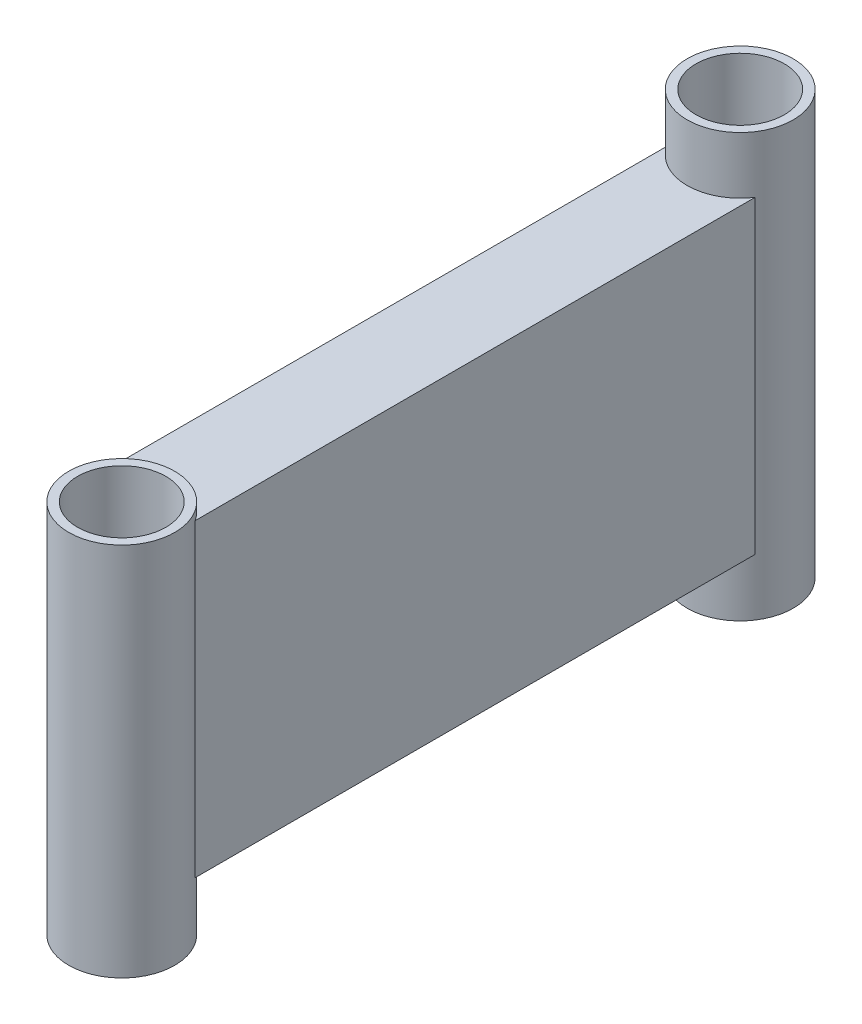
ISO-10303-21;
HEADER;
FILE_DESCRIPTION(('STEP AP214'),'2;1');
FILE_NAME('part.step','',(''),(''),'','','');
FILE_SCHEMA(('AUTOMOTIVE_DESIGN { 1 0 10303 214 1 1 1 1 }'));
ENDSEC;
DATA;
#1=APPLICATION_CONTEXT('core data for automotive mechanical design processes');
#2=APPLICATION_PROTOCOL_DEFINITION('international standard','automotive_design',2000,#1);
#3=PRODUCT_CONTEXT('',#1,'mechanical');
#4=PRODUCT('Part','Part','',(#3));
#5=PRODUCT_RELATED_PRODUCT_CATEGORY('part','',(#4));
#6=PRODUCT_DEFINITION_FORMATION('','',#4);
#7=PRODUCT_DEFINITION_CONTEXT('part definition',#1,'design');
#8=PRODUCT_DEFINITION('design','',#6,#7);
#9=PRODUCT_DEFINITION_SHAPE('','',#8);
#10=(LENGTH_UNIT() NAMED_UNIT(*) SI_UNIT(.MILLI.,.METRE.));
#11=(NAMED_UNIT(*) PLANE_ANGLE_UNIT() SI_UNIT($,.RADIAN.));
#12=(NAMED_UNIT(*) SI_UNIT($,.STERADIAN.) SOLID_ANGLE_UNIT());
#13=UNCERTAINTY_MEASURE_WITH_UNIT(LENGTH_MEASURE(1.E-05),#10,'distance_accuracy_value','');
#14=(GEOMETRIC_REPRESENTATION_CONTEXT(3) GLOBAL_UNCERTAINTY_ASSIGNED_CONTEXT((#13)) GLOBAL_UNIT_ASSIGNED_CONTEXT((#10,
#11,#12)) REPRESENTATION_CONTEXT('',''));
#15=CARTESIAN_POINT('',(0.,0.,0.));
#16=DIRECTION('',(0.,0.,1.));
#17=DIRECTION('',(1.,0.,0.));
#18=AXIS2_PLACEMENT_3D('',#15,#16,#17);
#19=CARTESIAN_POINT('',(0.,-23.9382502,65.));
#20=DIRECTION('',(0.,1.,0.));
#21=DIRECTION('',(0.,0.,1.));
#22=AXIS2_PLACEMENT_3D('',#19,#20,#21);
#23=CYLINDRICAL_SURFACE('',#22,6.00000000000001);
#24=CARTESIAN_POINT('',(0.,-23.9382502,65.));
#25=DIRECTION('',(0.,1.,0.));
#26=DIRECTION('',(0.,0.,1.));
#27=AXIS2_PLACEMENT_3D('',#24,#25,#26);
#28=CIRCLE('',#27,6.00000000000001);
#29=CARTESIAN_POINT('',(0.,-23.9382502,71.));
#30=VERTEX_POINT('',#29);
#31=EDGE_CURVE('E209',#30,#30,#28,.T.);
#32=ORIENTED_EDGE('',*,*,#31,.T.);
#33=EDGE_LOOP('',(#32));
#34=FACE_BOUND('',#33,.T.);
#35=CARTESIAN_POINT('',(0.,18.5,65.));
#36=DIRECTION('',(0.,1.,0.));
#37=DIRECTION('',(0.,0.,1.));
#38=AXIS2_PLACEMENT_3D('',#35,#36,#37);
#39=CIRCLE('',#38,6.00000000000001);
#40=CARTESIAN_POINT('',(0.,18.5,71.));
#41=VERTEX_POINT('',#40);
#42=EDGE_CURVE('E201',#41,#41,#39,.T.);
#43=ORIENTED_EDGE('',*,*,#42,.F.);
#44=EDGE_LOOP('',(#43));
#45=FACE_BOUND('',#44,.T.);
#46=CARTESIAN_POINT('',(0.,17.5,65.));
#47=DIRECTION('',(0.,-1.,0.));
#48=DIRECTION('',(0.,0.,-1.));
#49=AXIS2_PLACEMENT_3D('',#46,#47,#48);
#50=CIRCLE('',#49,6.00000000000001);
#51=CARTESIAN_POINT('',(-5.,17.5,61.6833752096446));
#52=VERTEX_POINT('',#51);
#53=CARTESIAN_POINT('',(5.,17.5,61.6833752096446));
#54=VERTEX_POINT('',#53);
#55=EDGE_CURVE('E105',#52,#54,#50,.T.);
#56=ORIENTED_EDGE('',*,*,#55,.F.);
#57=DIRECTION('',(0.,1.,0.));
#58=VECTOR('',#57,1.);
#59=CARTESIAN_POINT('',(-5.,-23.9382502,61.6833752096446));
#60=LINE('',#59,#58);
#61=CARTESIAN_POINT('',(-5.,-17.5,61.6833752096446));
#62=VERTEX_POINT('',#61);
#63=EDGE_CURVE('E186',#62,#52,#60,.T.);
#64=ORIENTED_EDGE('',*,*,#63,.F.);
#65=CARTESIAN_POINT('',(0.,-17.5,65.));
#66=DIRECTION('',(0.,1.,0.));
#67=DIRECTION('',(0.,0.,1.));
#68=AXIS2_PLACEMENT_3D('',#65,#66,#67);
#69=CIRCLE('',#68,6.00000000000001);
#70=CARTESIAN_POINT('',(5.,-17.5,61.6833752096446));
#71=VERTEX_POINT('',#70);
#72=EDGE_CURVE('E180',#71,#62,#69,.T.);
#73=ORIENTED_EDGE('',*,*,#72,.F.);
#74=DIRECTION('',(0.,1.,0.));
#75=VECTOR('',#74,1.);
#76=CARTESIAN_POINT('',(5.,-23.9382502,61.6833752096446));
#77=LINE('',#76,#75);
#78=EDGE_CURVE('E190',#54,#71,#77,.F.);
#79=ORIENTED_EDGE('',*,*,#78,.F.);
#80=EDGE_LOOP('',(#56,#64,#73,#79));
#81=FACE_BOUND('',#80,.T.);
#82=ADVANCED_FACE('F88',(#34,#45,#81),#23,.T.);
#83=CARTESIAN_POINT('',(0.,-23.9382502,-5.));
#84=DIRECTION('',(0.,1.,0.));
#85=DIRECTION('',(0.,0.,1.));
#86=AXIS2_PLACEMENT_3D('',#83,#84,#85);
#87=CYLINDRICAL_SURFACE('',#86,6.);
#88=CARTESIAN_POINT('',(0.,-23.9382502,-5.));
#89=DIRECTION('',(0.,1.,0.));
#90=DIRECTION('',(0.,0.,1.));
#91=AXIS2_PLACEMENT_3D('',#88,#89,#90);
#92=CIRCLE('',#91,6.);
#93=CARTESIAN_POINT('',(0.,-23.9382502,1.));
#94=VERTEX_POINT('',#93);
#95=EDGE_CURVE('E243',#94,#94,#92,.T.);
#96=ORIENTED_EDGE('',*,*,#95,.T.);
#97=EDGE_LOOP('',(#96));
#98=FACE_BOUND('',#97,.T.);
#99=CARTESIAN_POINT('',(0.,23.93825015,-5.));
#100=DIRECTION('',(0.,1.,0.));
#101=DIRECTION('',(0.,0.,1.));
#102=AXIS2_PLACEMENT_3D('',#99,#100,#101);
#103=CIRCLE('',#102,6.);
#104=CARTESIAN_POINT('',(0.,23.93825015,1.));
#105=VERTEX_POINT('',#104);
#106=EDGE_CURVE('E235',#105,#105,#103,.T.);
#107=ORIENTED_EDGE('',*,*,#106,.F.);
#108=EDGE_LOOP('',(#107));
#109=FACE_BOUND('',#108,.T.);
#110=CARTESIAN_POINT('',(0.,17.5,-5.));
#111=DIRECTION('',(0.,-1.,0.));
#112=DIRECTION('',(0.,0.,-1.));
#113=AXIS2_PLACEMENT_3D('',#110,#111,#112);
#114=CIRCLE('',#113,6.);
#115=CARTESIAN_POINT('',(5.,17.5,-1.6833752096446));
#116=VERTEX_POINT('',#115);
#117=CARTESIAN_POINT('',(-5.,17.5,-1.6833752096446));
#118=VERTEX_POINT('',#117);
#119=EDGE_CURVE('E247',#116,#118,#114,.T.);
#120=ORIENTED_EDGE('',*,*,#119,.F.);
#121=DIRECTION('',(0.,1.,0.));
#122=VECTOR('',#121,1.);
#123=CARTESIAN_POINT('',(5.,-23.9382502,-1.6833752096446));
#124=LINE('',#123,#122);
#125=CARTESIAN_POINT('',(5.,-17.5,-1.6833752096446));
#126=VERTEX_POINT('',#125);
#127=EDGE_CURVE('E217',#126,#116,#124,.T.);
#128=ORIENTED_EDGE('',*,*,#127,.F.);
#129=CARTESIAN_POINT('',(0.,-17.5,-5.));
#130=DIRECTION('',(0.,1.,0.));
#131=DIRECTION('',(0.,0.,1.));
#132=AXIS2_PLACEMENT_3D('',#129,#130,#131);
#133=CIRCLE('',#132,6.);
#134=CARTESIAN_POINT('',(-5.,-17.5,-1.6833752096446));
#135=VERTEX_POINT('',#134);
#136=EDGE_CURVE('E253',#135,#126,#133,.T.);
#137=ORIENTED_EDGE('',*,*,#136,.F.);
#138=DIRECTION('',(0.,1.,0.));
#139=VECTOR('',#138,1.);
#140=CARTESIAN_POINT('',(-5.,-23.9382502,-1.68337520964459));
#141=LINE('',#140,#139);
#142=EDGE_CURVE('E226',#118,#135,#141,.F.);
#143=ORIENTED_EDGE('',*,*,#142,.F.);
#144=EDGE_LOOP('',(#120,#128,#137,#143));
#145=FACE_BOUND('',#144,.T.);
#146=ADVANCED_FACE('F291',(#98,#109,#145),#87,.T.);
#147=CARTESIAN_POINT('',(-5.,-17.5,60.));
#148=DIRECTION('',(1.,0.,0.));
#149=DIRECTION('',(0.,0.,-1.));
#150=AXIS2_PLACEMENT_3D('',#147,#148,#149);
#151=PLANE('',#150);
#152=DIRECTION('',(0.,0.,-1.));
#153=VECTOR('',#152,1.);
#154=CARTESIAN_POINT('',(-5.,17.5,60.));
#155=LINE('',#154,#153);
#156=EDGE_CURVE('E170',#52,#118,#155,.T.);
#157=ORIENTED_EDGE('',*,*,#156,.T.);
#158=ORIENTED_EDGE('',*,*,#142,.T.);
#159=DIRECTION('',(0.,0.,-1.));
#160=VECTOR('',#159,1.);
#161=CARTESIAN_POINT('',(-5.,-17.5,60.));
#162=LINE('',#161,#160);
#163=EDGE_CURVE('E113',#62,#135,#162,.T.);
#164=ORIENTED_EDGE('',*,*,#163,.F.);
#165=ORIENTED_EDGE('',*,*,#63,.T.);
#166=EDGE_LOOP('',(#157,#158,#164,#165));
#167=FACE_BOUND('',#166,.T.);
#168=ADVANCED_FACE('F90',(#167),#151,.F.);
#169=CARTESIAN_POINT('',(5.,-17.5,60.));
#170=DIRECTION('',(0.,1.,0.));
#171=DIRECTION('',(0.,0.,1.));
#172=AXIS2_PLACEMENT_3D('',#169,#170,#171);
#173=PLANE('',#172);
#174=DIRECTION('',(0.,0.,-1.));
#175=VECTOR('',#174,1.);
#176=CARTESIAN_POINT('',(5.,-17.5,60.));
#177=LINE('',#176,#175);
#178=EDGE_CURVE('E268',#71,#126,#177,.T.);
#179=ORIENTED_EDGE('',*,*,#178,.F.);
#180=ORIENTED_EDGE('',*,*,#72,.T.);
#181=ORIENTED_EDGE('',*,*,#163,.T.);
#182=ORIENTED_EDGE('',*,*,#136,.T.);
#183=EDGE_LOOP('',(#179,#180,#181,#182));
#184=FACE_BOUND('',#183,.T.);
#185=ADVANCED_FACE('F305',(#184),#173,.F.);
#186=CARTESIAN_POINT('',(5.,-17.5,60.));
#187=DIRECTION('',(-1.,0.,0.));
#188=DIRECTION('',(0.,0.,1.));
#189=AXIS2_PLACEMENT_3D('',#186,#187,#188);
#190=PLANE('',#189);
#191=ORIENTED_EDGE('',*,*,#178,.T.);
#192=ORIENTED_EDGE('',*,*,#127,.T.);
#193=DIRECTION('',(0.,0.,-1.));
#194=VECTOR('',#193,1.);
#195=CARTESIAN_POINT('',(5.,17.5,60.));
#196=LINE('',#195,#194);
#197=EDGE_CURVE('E265',#54,#116,#196,.T.);
#198=ORIENTED_EDGE('',*,*,#197,.F.);
#199=ORIENTED_EDGE('',*,*,#78,.T.);
#200=EDGE_LOOP('',(#191,#192,#198,#199));
#201=FACE_BOUND('',#200,.T.);
#202=ADVANCED_FACE('F302',(#201),#190,.F.);
#203=CARTESIAN_POINT('',(5.,17.5,60.));
#204=DIRECTION('',(0.,-1.,0.));
#205=DIRECTION('',(0.,0.,-1.));
#206=AXIS2_PLACEMENT_3D('',#203,#204,#205);
#207=PLANE('',#206);
#208=ORIENTED_EDGE('',*,*,#156,.F.);
#209=ORIENTED_EDGE('',*,*,#55,.T.);
#210=ORIENTED_EDGE('',*,*,#197,.T.);
#211=ORIENTED_EDGE('',*,*,#119,.T.);
#212=EDGE_LOOP('',(#208,#209,#210,#211));
#213=FACE_BOUND('',#212,.T.);
#214=ADVANCED_FACE('F298',(#213),#207,.F.);
#215=CARTESIAN_POINT('',(0.,-23.9382502,-5.));
#216=DIRECTION('',(0.,1.,0.));
#217=DIRECTION('',(0.,0.,1.));
#218=AXIS2_PLACEMENT_3D('',#215,#216,#217);
#219=PLANE('',#218);
#220=CARTESIAN_POINT('',(0.,-23.9382502,-5.));
#221=DIRECTION('',(0.,1.,0.));
#222=DIRECTION('',(0.,0.,1.));
#223=AXIS2_PLACEMENT_3D('',#220,#221,#222);
#224=CIRCLE('',#223,5.);
#225=CARTESIAN_POINT('',(0.,-23.9382502,0.));
#226=VERTEX_POINT('',#225);
#227=EDGE_CURVE('E239',#226,#226,#224,.T.);
#228=ORIENTED_EDGE('',*,*,#227,.T.);
#229=EDGE_LOOP('',(#228));
#230=FACE_BOUND('',#229,.T.);
#231=ORIENTED_EDGE('',*,*,#95,.F.);
#232=EDGE_LOOP('',(#231));
#233=FACE_BOUND('',#232,.T.);
#234=ADVANCED_FACE('F301',(#230,#233),#219,.F.);
#235=CARTESIAN_POINT('',(0.,-23.9382502,-5.));
#236=DIRECTION('',(0.,1.,0.));
#237=DIRECTION('',(0.,0.,1.));
#238=AXIS2_PLACEMENT_3D('',#235,#236,#237);
#239=CYLINDRICAL_SURFACE('',#238,5.);
#240=ORIENTED_EDGE('',*,*,#227,.F.);
#241=EDGE_LOOP('',(#240));
#242=FACE_BOUND('',#241,.T.);
#243=CARTESIAN_POINT('',(0.,23.93825015,-5.));
#244=DIRECTION('',(0.,1.,0.));
#245=DIRECTION('',(0.,0.,1.));
#246=AXIS2_PLACEMENT_3D('',#243,#244,#245);
#247=CIRCLE('',#246,5.);
#248=CARTESIAN_POINT('',(0.,23.93825015,0.));
#249=VERTEX_POINT('',#248);
#250=EDGE_CURVE('E229',#249,#249,#247,.T.);
#251=ORIENTED_EDGE('',*,*,#250,.T.);
#252=EDGE_LOOP('',(#251));
#253=FACE_BOUND('',#252,.T.);
#254=ADVANCED_FACE('F468',(#242,#253),#239,.F.);
#255=CARTESIAN_POINT('',(0.,23.93825015,-5.));
#256=DIRECTION('',(0.,1.,0.));
#257=DIRECTION('',(0.,0.,1.));
#258=AXIS2_PLACEMENT_3D('',#255,#256,#257);
#259=PLANE('',#258);
#260=ORIENTED_EDGE('',*,*,#106,.T.);
#261=EDGE_LOOP('',(#260));
#262=FACE_BOUND('',#261,.T.);
#263=ORIENTED_EDGE('',*,*,#250,.F.);
#264=EDGE_LOOP('',(#263));
#265=FACE_BOUND('',#264,.T.);
#266=ADVANCED_FACE('F358',(#262,#265),#259,.T.);
#267=CARTESIAN_POINT('',(0.,-23.9382502,65.));
#268=DIRECTION('',(0.,1.,0.));
#269=DIRECTION('',(0.,0.,1.));
#270=AXIS2_PLACEMENT_3D('',#267,#268,#269);
#271=PLANE('',#270);
#272=CARTESIAN_POINT('',(0.,-23.9382502,65.));
#273=DIRECTION('',(0.,1.,0.));
#274=DIRECTION('',(0.,0.,1.));
#275=AXIS2_PLACEMENT_3D('',#272,#273,#274);
#276=CIRCLE('',#275,5.00000000000001);
#277=CARTESIAN_POINT('',(0.,-23.9382502,70.));
#278=VERTEX_POINT('',#277);
#279=EDGE_CURVE('E205',#278,#278,#276,.T.);
#280=ORIENTED_EDGE('',*,*,#279,.T.);
#281=EDGE_LOOP('',(#280));
#282=FACE_BOUND('',#281,.T.);
#283=ORIENTED_EDGE('',*,*,#31,.F.);
#284=EDGE_LOOP('',(#283));
#285=FACE_BOUND('',#284,.T.);
#286=ADVANCED_FACE('F352',(#282,#285),#271,.F.);
#287=CARTESIAN_POINT('',(0.,-23.9382502,65.));
#288=DIRECTION('',(0.,1.,0.));
#289=DIRECTION('',(0.,0.,1.));
#290=AXIS2_PLACEMENT_3D('',#287,#288,#289);
#291=CYLINDRICAL_SURFACE('',#290,5.00000000000001);
#292=ORIENTED_EDGE('',*,*,#279,.F.);
#293=EDGE_LOOP('',(#292));
#294=FACE_BOUND('',#293,.T.);
#295=CARTESIAN_POINT('',(0.,18.5,65.));
#296=DIRECTION('',(0.,1.,0.));
#297=DIRECTION('',(0.,0.,1.));
#298=AXIS2_PLACEMENT_3D('',#295,#296,#297);
#299=CIRCLE('',#298,5.00000000000001);
#300=CARTESIAN_POINT('',(0.,18.5,70.));
#301=VERTEX_POINT('',#300);
#302=EDGE_CURVE('E196',#301,#301,#299,.T.);
#303=ORIENTED_EDGE('',*,*,#302,.T.);
#304=EDGE_LOOP('',(#303));
#305=FACE_BOUND('',#304,.T.);
#306=ADVANCED_FACE('F357',(#294,#305),#291,.F.);
#307=CARTESIAN_POINT('',(0.,18.5,65.));
#308=DIRECTION('',(0.,1.,0.));
#309=DIRECTION('',(0.,0.,1.));
#310=AXIS2_PLACEMENT_3D('',#307,#308,#309);
#311=PLANE('',#310);
#312=ORIENTED_EDGE('',*,*,#42,.T.);
#313=EDGE_LOOP('',(#312));
#314=FACE_BOUND('',#313,.T.);
#315=ORIENTED_EDGE('',*,*,#302,.F.);
#316=EDGE_LOOP('',(#315));
#317=FACE_BOUND('',#316,.T.);
#318=ADVANCED_FACE('F369',(#314,#317),#311,.T.);
#319=CLOSED_SHELL('',(#82,#146,#168,#185,#202,#214,#234,#254,#266,#286,#306,#318));
#320=CARTESIAN_POINT('',(4.,-16.5,60.));
#321=DIRECTION('',(-1.,0.,0.));
#322=DIRECTION('',(0.,0.,1.));
#323=AXIS2_PLACEMENT_3D('',#320,#321,#322);
#324=PLANE('',#323);
#325=DIRECTION('',(0.,0.,-1.));
#326=VECTOR('',#325,1.);
#327=CARTESIAN_POINT('',(4.,16.5,60.));
#328=LINE('',#327,#326);
#329=CARTESIAN_POINT('',(4.,16.5,60.5278640450004));
#330=VERTEX_POINT('',#329);
#331=CARTESIAN_POINT('',(4.,16.5,-0.527864045000418));
#332=VERTEX_POINT('',#331);
#333=EDGE_CURVE('E258',#330,#332,#328,.T.);
#334=ORIENTED_EDGE('',*,*,#333,.T.);
#335=DIRECTION('',(0.,1.,0.));
#336=VECTOR('',#335,1.);
#337=CARTESIAN_POINT('',(4.,-23.9382502,-0.527864045000418));
#338=LINE('',#337,#336);
#339=CARTESIAN_POINT('',(4.,-16.5,-0.527864045000418));
#340=VERTEX_POINT('',#339);
#341=EDGE_CURVE('E218',#340,#332,#338,.T.);
#342=ORIENTED_EDGE('',*,*,#341,.F.);
#343=DIRECTION('',(0.,0.,-1.));
#344=VECTOR('',#343,1.);
#345=CARTESIAN_POINT('',(4.,-16.5,60.));
#346=LINE('',#345,#344);
#347=CARTESIAN_POINT('',(4.,-16.5,60.5278640450004));
#348=VERTEX_POINT('',#347);
#349=EDGE_CURVE('E171',#348,#340,#346,.T.);
#350=ORIENTED_EDGE('',*,*,#349,.F.);
#351=DIRECTION('',(0.,1.,0.));
#352=VECTOR('',#351,1.);
#353=CARTESIAN_POINT('',(4.,-23.9382502,60.5278640450004));
#354=LINE('',#353,#352);
#355=EDGE_CURVE('E178',#330,#348,#354,.F.);
#356=ORIENTED_EDGE('',*,*,#355,.F.);
#357=EDGE_LOOP('',(#334,#342,#350,#356));
#358=FACE_BOUND('',#357,.T.);
#359=ADVANCED_FACE('F282',(#358),#324,.T.);
#360=ORIENTED_EDGE('',*,*,#341,.T.);
#361=CARTESIAN_POINT('',(0.,16.5,-5.));
#362=DIRECTION('',(0.,-1.,0.));
#363=DIRECTION('',(0.,0.,-1.));
#364=AXIS2_PLACEMENT_3D('',#361,#362,#363);
#365=CIRCLE('',#364,6.);
#366=CARTESIAN_POINT('',(-4.,16.5,-0.52786404500042));
#367=VERTEX_POINT('',#366);
#368=EDGE_CURVE('E98',#332,#367,#365,.T.);
#369=ORIENTED_EDGE('',*,*,#368,.T.);
#370=DIRECTION('',(0.,1.,0.));
#371=VECTOR('',#370,1.);
#372=CARTESIAN_POINT('',(-4.,-23.9382502,-0.527864045000418));
#373=LINE('',#372,#371);
#374=CARTESIAN_POINT('',(-4.,-16.5,-0.527864045000418));
#375=VERTEX_POINT('',#374);
#376=EDGE_CURVE('E222',#367,#375,#373,.F.);
#377=ORIENTED_EDGE('',*,*,#376,.T.);
#378=CARTESIAN_POINT('',(0.,-16.5,-5.));
#379=DIRECTION('',(0.,1.,0.));
#380=DIRECTION('',(0.,0.,1.));
#381=AXIS2_PLACEMENT_3D('',#378,#379,#380);
#382=CIRCLE('',#381,6.);
#383=EDGE_CURVE('E164',#375,#340,#382,.T.);
#384=ORIENTED_EDGE('',*,*,#383,.T.);
#385=EDGE_LOOP('',(#360,#369,#377,#384));
#386=FACE_BOUND('',#385,.T.);
#387=ADVANCED_FACE('F277',(#386),#87,.T.);
#388=CARTESIAN_POINT('',(4.,16.5,60.));
#389=DIRECTION('',(0.,-1.,0.));
#390=DIRECTION('',(0.,0.,-1.));
#391=AXIS2_PLACEMENT_3D('',#388,#389,#390);
#392=PLANE('',#391);
#393=CARTESIAN_POINT('',(0.,16.5,65.));
#394=DIRECTION('',(0.,-1.,0.));
#395=DIRECTION('',(0.,0.,-1.));
#396=AXIS2_PLACEMENT_3D('',#393,#394,#395);
#397=CIRCLE('',#396,6.00000000000001);
#398=CARTESIAN_POINT('',(-4.,16.5,60.5278640450004));
#399=VERTEX_POINT('',#398);
#400=EDGE_CURVE('E12',#399,#330,#397,.T.);
#401=ORIENTED_EDGE('',*,*,#400,.F.);
#402=DIRECTION('',(0.,0.,-1.));
#403=VECTOR('',#402,1.);
#404=CARTESIAN_POINT('',(-4.,16.5,60.));
#405=LINE('',#404,#403);
#406=EDGE_CURVE('E184',#399,#367,#405,.T.);
#407=ORIENTED_EDGE('',*,*,#406,.T.);
#408=ORIENTED_EDGE('',*,*,#368,.F.);
#409=ORIENTED_EDGE('',*,*,#333,.F.);
#410=EDGE_LOOP('',(#401,#407,#408,#409));
#411=FACE_BOUND('',#410,.T.);
#412=ADVANCED_FACE('F280',(#411),#392,.T.);
#413=CARTESIAN_POINT('',(4.,-16.5,60.));
#414=DIRECTION('',(0.,1.,0.));
#415=DIRECTION('',(0.,0.,1.));
#416=AXIS2_PLACEMENT_3D('',#413,#414,#415);
#417=PLANE('',#416);
#418=CARTESIAN_POINT('',(0.,-16.5,65.));
#419=DIRECTION('',(0.,1.,0.));
#420=DIRECTION('',(0.,0.,1.));
#421=AXIS2_PLACEMENT_3D('',#418,#419,#420);
#422=CIRCLE('',#421,6.00000000000001);
#423=CARTESIAN_POINT('',(-4.,-16.5,60.5278640450004));
#424=VERTEX_POINT('',#423);
#425=EDGE_CURVE('E162',#348,#424,#422,.T.);
#426=ORIENTED_EDGE('',*,*,#425,.F.);
#427=ORIENTED_EDGE('',*,*,#349,.T.);
#428=ORIENTED_EDGE('',*,*,#383,.F.);
#429=DIRECTION('',(0.,0.,-1.));
#430=VECTOR('',#429,1.);
#431=CARTESIAN_POINT('',(-4.,-16.5,60.));
#432=LINE('',#431,#430);
#433=EDGE_CURVE('E158',#424,#375,#432,.T.);
#434=ORIENTED_EDGE('',*,*,#433,.F.);
#435=EDGE_LOOP('',(#426,#427,#428,#434));
#436=FACE_BOUND('',#435,.T.);
#437=ADVANCED_FACE('F160',(#436),#417,.T.);
#438=CARTESIAN_POINT('',(-4.,-16.5,60.));
#439=DIRECTION('',(1.,0.,0.));
#440=DIRECTION('',(0.,0.,-1.));
#441=AXIS2_PLACEMENT_3D('',#438,#439,#440);
#442=PLANE('',#441);
#443=ORIENTED_EDGE('',*,*,#433,.T.);
#444=ORIENTED_EDGE('',*,*,#376,.F.);
#445=ORIENTED_EDGE('',*,*,#406,.F.);
#446=DIRECTION('',(0.,1.,0.));
#447=VECTOR('',#446,1.);
#448=CARTESIAN_POINT('',(-4.,-23.9382502,60.5278640450004));
#449=LINE('',#448,#447);
#450=EDGE_CURVE('E176',#424,#399,#449,.T.);
#451=ORIENTED_EDGE('',*,*,#450,.F.);
#452=EDGE_LOOP('',(#443,#444,#445,#451));
#453=FACE_BOUND('',#452,.T.);
#454=ADVANCED_FACE('F183',(#453),#442,.T.);
#455=ORIENTED_EDGE('',*,*,#450,.T.);
#456=ORIENTED_EDGE('',*,*,#400,.T.);
#457=ORIENTED_EDGE('',*,*,#355,.T.);
#458=ORIENTED_EDGE('',*,*,#425,.T.);
#459=EDGE_LOOP('',(#455,#456,#457,#458));
#460=FACE_BOUND('',#459,.T.);
#461=ADVANCED_FACE('F175',(#460),#23,.T.);
#462=CLOSED_SHELL('',(#359,#387,#412,#437,#454,#461));
#463=ORIENTED_CLOSED_SHELL('',*,#462,.T.);
#464=BREP_WITH_VOIDS('B2',#319,(#463));
#465=ADVANCED_BREP_SHAPE_REPRESENTATION('',(#18,#464),#14);
#466=SHAPE_DEFINITION_REPRESENTATION(#9,#465);
ENDSEC;
END-ISO-10303-21;
